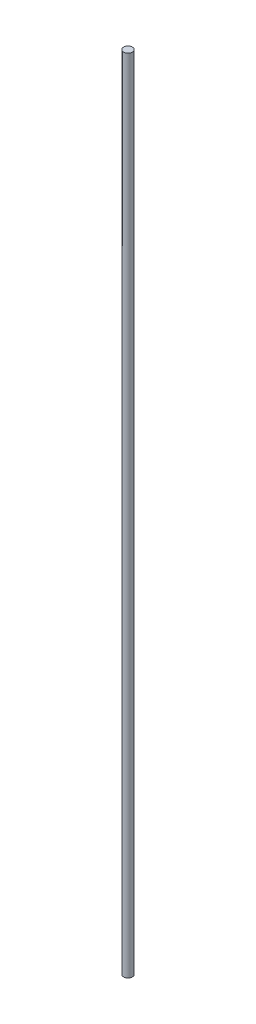
ISO-10303-21;
HEADER;
FILE_DESCRIPTION(('STEP AP214'),'2;1');
FILE_NAME('part.step','',(''),(''),'','','');
FILE_SCHEMA(('AUTOMOTIVE_DESIGN { 1 0 10303 214 1 1 1 1 }'));
ENDSEC;
DATA;
#1=APPLICATION_CONTEXT('core data for automotive mechanical design processes');
#2=APPLICATION_PROTOCOL_DEFINITION('international standard','automotive_design',2000,#1);
#3=PRODUCT_CONTEXT('',#1,'mechanical');
#4=PRODUCT('Part','Part','',(#3));
#5=PRODUCT_RELATED_PRODUCT_CATEGORY('part','',(#4));
#6=PRODUCT_DEFINITION_FORMATION('','',#4);
#7=PRODUCT_DEFINITION_CONTEXT('part definition',#1,'design');
#8=PRODUCT_DEFINITION('design','',#6,#7);
#9=PRODUCT_DEFINITION_SHAPE('','',#8);
#10=(LENGTH_UNIT() NAMED_UNIT(*) SI_UNIT(.MILLI.,.METRE.));
#11=(NAMED_UNIT(*) PLANE_ANGLE_UNIT() SI_UNIT($,.RADIAN.));
#12=(NAMED_UNIT(*) SI_UNIT($,.STERADIAN.) SOLID_ANGLE_UNIT());
#13=UNCERTAINTY_MEASURE_WITH_UNIT(LENGTH_MEASURE(1.E-05),#10,'distance_accuracy_value','');
#14=(GEOMETRIC_REPRESENTATION_CONTEXT(3) GLOBAL_UNCERTAINTY_ASSIGNED_CONTEXT((#13)) GLOBAL_UNIT_ASSIGNED_CONTEXT((#10,
#11,#12)) REPRESENTATION_CONTEXT('',''));
#15=CARTESIAN_POINT('',(0.,0.,0.));
#16=DIRECTION('',(0.,0.,1.));
#17=DIRECTION('',(1.,0.,0.));
#18=AXIS2_PLACEMENT_3D('',#15,#16,#17);
#19=CARTESIAN_POINT('',(0.,173.,0.));
#20=DIRECTION('',(0.,-1.,0.));
#21=DIRECTION('',(0.,0.,-1.));
#22=AXIS2_PLACEMENT_3D('',#19,#20,#21);
#23=CYLINDRICAL_SURFACE('',#22,0.95);
#24=CARTESIAN_POINT('',(0.,173.,0.));
#25=DIRECTION('',(0.,1.,0.));
#26=DIRECTION('',(0.,0.,1.));
#27=AXIS2_PLACEMENT_3D('',#24,#25,#26);
#28=CIRCLE('',#27,0.95);
#29=CARTESIAN_POINT('',(0.,173.,0.95));
#30=VERTEX_POINT('',#29);
#31=EDGE_CURVE('E10',#30,#30,#28,.T.);
#32=ORIENTED_EDGE('',*,*,#31,.F.);
#33=EDGE_LOOP('',(#32));
#34=FACE_BOUND('',#33,.T.);
#35=CARTESIAN_POINT('',(0.,0.,0.));
#36=DIRECTION('',(0.,1.,0.));
#37=DIRECTION('',(0.,0.,1.));
#38=AXIS2_PLACEMENT_3D('',#35,#36,#37);
#39=CIRCLE('',#38,0.95);
#40=CARTESIAN_POINT('',(0.,0.,0.95));
#41=VERTEX_POINT('',#40);
#42=EDGE_CURVE('E33',#41,#41,#39,.T.);
#43=ORIENTED_EDGE('',*,*,#42,.T.);
#44=EDGE_LOOP('',(#43));
#45=FACE_BOUND('',#44,.T.);
#46=ADVANCED_FACE('F30',(#34,#45),#23,.T.);
#47=CARTESIAN_POINT('',(0.,173.,0.));
#48=DIRECTION('',(0.,1.,0.));
#49=DIRECTION('',(0.,0.,1.));
#50=AXIS2_PLACEMENT_3D('',#47,#48,#49);
#51=PLANE('',#50);
#52=ORIENTED_EDGE('',*,*,#31,.T.);
#53=EDGE_LOOP('',(#52));
#54=FACE_BOUND('',#53,.T.);
#55=ADVANCED_FACE('F45',(#54),#51,.T.);
#56=CARTESIAN_POINT('',(0.,0.,0.));
#57=DIRECTION('',(0.,1.,0.));
#58=DIRECTION('',(0.,0.,1.));
#59=AXIS2_PLACEMENT_3D('',#56,#57,#58);
#60=PLANE('',#59);
#61=ORIENTED_EDGE('',*,*,#42,.F.);
#62=EDGE_LOOP('',(#61));
#63=FACE_BOUND('',#62,.T.);
#64=ADVANCED_FACE('F43',(#63),#60,.F.);
#65=CLOSED_SHELL('',(#46,#55,#64));
#66=MANIFOLD_SOLID_BREP('B2',#65);
#67=ADVANCED_BREP_SHAPE_REPRESENTATION('',(#18,#66),#14);
#68=SHAPE_DEFINITION_REPRESENTATION(#9,#67);
ENDSEC;
END-ISO-10303-21;
